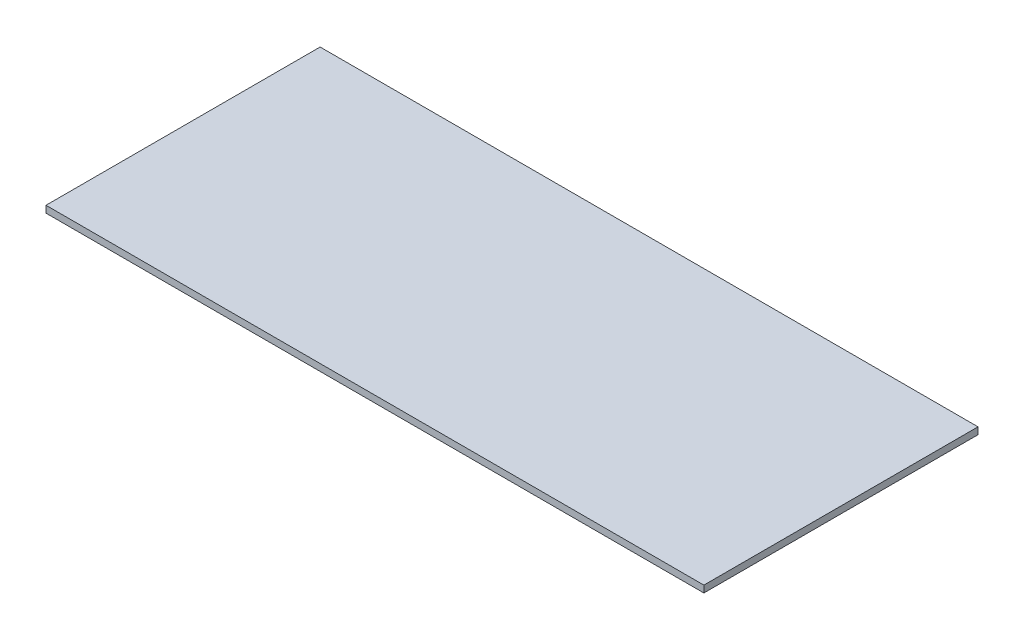
ISO-10303-21;
HEADER;
FILE_DESCRIPTION(('STEP AP214'),'2;1');
FILE_NAME('part.step','',(''),(''),'','','');
FILE_SCHEMA(('AUTOMOTIVE_DESIGN { 1 0 10303 214 1 1 1 1 }'));
ENDSEC;
DATA;
#1=APPLICATION_CONTEXT('core data for automotive mechanical design processes');
#2=APPLICATION_PROTOCOL_DEFINITION('international standard','automotive_design',2000,#1);
#3=PRODUCT_CONTEXT('',#1,'mechanical');
#4=PRODUCT('Part','Part','',(#3));
#5=PRODUCT_RELATED_PRODUCT_CATEGORY('part','',(#4));
#6=PRODUCT_DEFINITION_FORMATION('','',#4);
#7=PRODUCT_DEFINITION_CONTEXT('part definition',#1,'design');
#8=PRODUCT_DEFINITION('design','',#6,#7);
#9=PRODUCT_DEFINITION_SHAPE('','',#8);
#10=(LENGTH_UNIT() NAMED_UNIT(*) SI_UNIT(.MILLI.,.METRE.));
#11=(NAMED_UNIT(*) PLANE_ANGLE_UNIT() SI_UNIT($,.RADIAN.));
#12=(NAMED_UNIT(*) SI_UNIT($,.STERADIAN.) SOLID_ANGLE_UNIT());
#13=UNCERTAINTY_MEASURE_WITH_UNIT(LENGTH_MEASURE(1.E-05),#10,'distance_accuracy_value','');
#14=(GEOMETRIC_REPRESENTATION_CONTEXT(3) GLOBAL_UNCERTAINTY_ASSIGNED_CONTEXT((#13)) GLOBAL_UNIT_ASSIGNED_CONTEXT((#10,
#11,#12)) REPRESENTATION_CONTEXT('',''));
#15=CARTESIAN_POINT('',(0.,0.,0.));
#16=DIRECTION('',(0.,0.,1.));
#17=DIRECTION('',(1.,0.,0.));
#18=AXIS2_PLACEMENT_3D('',#15,#16,#17);
#19=CARTESIAN_POINT('',(-144.,3.,60.));
#20=DIRECTION('',(1.,0.,0.));
#21=DIRECTION('',(0.,0.,-1.));
#22=AXIS2_PLACEMENT_3D('',#19,#20,#21);
#23=PLANE('',#22);
#24=DIRECTION('',(0.,0.,1.));
#25=VECTOR('',#24,1.);
#26=CARTESIAN_POINT('',(-144.,0.,60.));
#27=LINE('',#26,#25);
#28=CARTESIAN_POINT('',(-144.,0.,-60.));
#29=VERTEX_POINT('',#28);
#30=CARTESIAN_POINT('',(-144.,0.,60.));
#31=VERTEX_POINT('',#30);
#32=EDGE_CURVE('E96',#29,#31,#27,.T.);
#33=ORIENTED_EDGE('',*,*,#32,.T.);
#34=DIRECTION('',(0.,-1.,0.));
#35=VECTOR('',#34,1.);
#36=CARTESIAN_POINT('',(-144.,3.,60.));
#37=LINE('',#36,#35);
#38=CARTESIAN_POINT('',(-144.,3.,60.));
#39=VERTEX_POINT('',#38);
#40=EDGE_CURVE('E11',#39,#31,#37,.T.);
#41=ORIENTED_EDGE('',*,*,#40,.F.);
#42=DIRECTION('',(0.,0.,1.));
#43=VECTOR('',#42,1.);
#44=CARTESIAN_POINT('',(-144.,3.,60.));
#45=LINE('',#44,#43);
#46=CARTESIAN_POINT('',(-144.,3.,-60.));
#47=VERTEX_POINT('',#46);
#48=EDGE_CURVE('E84',#47,#39,#45,.T.);
#49=ORIENTED_EDGE('',*,*,#48,.F.);
#50=DIRECTION('',(0.,-1.,0.));
#51=VECTOR('',#50,1.);
#52=CARTESIAN_POINT('',(-144.,3.,-60.));
#53=LINE('',#52,#51);
#54=EDGE_CURVE('E92',#47,#29,#53,.T.);
#55=ORIENTED_EDGE('',*,*,#54,.T.);
#56=EDGE_LOOP('',(#33,#41,#49,#55));
#57=FACE_BOUND('',#56,.T.);
#58=ADVANCED_FACE('F33',(#57),#23,.F.);
#59=CARTESIAN_POINT('',(144.,3.,60.));
#60=DIRECTION('',(0.,0.,-1.));
#61=DIRECTION('',(-1.,0.,0.));
#62=AXIS2_PLACEMENT_3D('',#59,#60,#61);
#63=PLANE('',#62);
#64=DIRECTION('',(1.,0.,0.));
#65=VECTOR('',#64,1.);
#66=CARTESIAN_POINT('',(144.,0.,60.));
#67=LINE('',#66,#65);
#68=CARTESIAN_POINT('',(144.,0.,60.));
#69=VERTEX_POINT('',#68);
#70=EDGE_CURVE('E88',#31,#69,#67,.T.);
#71=ORIENTED_EDGE('',*,*,#70,.T.);
#72=DIRECTION('',(0.,-1.,0.));
#73=VECTOR('',#72,1.);
#74=CARTESIAN_POINT('',(144.,3.,60.));
#75=LINE('',#74,#73);
#76=CARTESIAN_POINT('',(144.,3.,60.));
#77=VERTEX_POINT('',#76);
#78=EDGE_CURVE('E41',#77,#69,#75,.T.);
#79=ORIENTED_EDGE('',*,*,#78,.F.);
#80=DIRECTION('',(1.,0.,0.));
#81=VECTOR('',#80,1.);
#82=CARTESIAN_POINT('',(144.,3.,60.));
#83=LINE('',#82,#81);
#84=EDGE_CURVE('E79',#39,#77,#83,.T.);
#85=ORIENTED_EDGE('',*,*,#84,.F.);
#86=ORIENTED_EDGE('',*,*,#40,.T.);
#87=EDGE_LOOP('',(#71,#79,#85,#86));
#88=FACE_BOUND('',#87,.T.);
#89=ADVANCED_FACE('F87',(#88),#63,.F.);
#90=CARTESIAN_POINT('',(144.,3.,60.));
#91=DIRECTION('',(-1.,0.,0.));
#92=DIRECTION('',(0.,0.,1.));
#93=AXIS2_PLACEMENT_3D('',#90,#91,#92);
#94=PLANE('',#93);
#95=DIRECTION('',(0.,0.,-1.));
#96=VECTOR('',#95,1.);
#97=CARTESIAN_POINT('',(144.,0.,60.));
#98=LINE('',#97,#96);
#99=CARTESIAN_POINT('',(144.,0.,-60.));
#100=VERTEX_POINT('',#99);
#101=EDGE_CURVE('E66',#69,#100,#98,.T.);
#102=ORIENTED_EDGE('',*,*,#101,.T.);
#103=DIRECTION('',(0.,-1.,0.));
#104=VECTOR('',#103,1.);
#105=CARTESIAN_POINT('',(144.,3.,-60.));
#106=LINE('',#105,#104);
#107=CARTESIAN_POINT('',(144.,3.,-60.));
#108=VERTEX_POINT('',#107);
#109=EDGE_CURVE('E89',#108,#100,#106,.T.);
#110=ORIENTED_EDGE('',*,*,#109,.F.);
#111=DIRECTION('',(0.,0.,-1.));
#112=VECTOR('',#111,1.);
#113=CARTESIAN_POINT('',(144.,3.,60.));
#114=LINE('',#113,#112);
#115=EDGE_CURVE('E82',#77,#108,#114,.T.);
#116=ORIENTED_EDGE('',*,*,#115,.F.);
#117=ORIENTED_EDGE('',*,*,#78,.T.);
#118=EDGE_LOOP('',(#102,#110,#116,#117));
#119=FACE_BOUND('',#118,.T.);
#120=ADVANCED_FACE('F90',(#119),#94,.F.);
#121=CARTESIAN_POINT('',(144.,3.,-60.));
#122=DIRECTION('',(0.,0.,1.));
#123=DIRECTION('',(1.,0.,0.));
#124=AXIS2_PLACEMENT_3D('',#121,#122,#123);
#125=PLANE('',#124);
#126=DIRECTION('',(-1.,0.,0.));
#127=VECTOR('',#126,1.);
#128=CARTESIAN_POINT('',(144.,0.,-60.));
#129=LINE('',#128,#127);
#130=EDGE_CURVE('E72',#100,#29,#129,.T.);
#131=ORIENTED_EDGE('',*,*,#130,.T.);
#132=ORIENTED_EDGE('',*,*,#54,.F.);
#133=DIRECTION('',(-1.,0.,0.));
#134=VECTOR('',#133,1.);
#135=CARTESIAN_POINT('',(144.,3.,-60.));
#136=LINE('',#135,#134);
#137=EDGE_CURVE('E49',#108,#47,#136,.T.);
#138=ORIENTED_EDGE('',*,*,#137,.F.);
#139=ORIENTED_EDGE('',*,*,#109,.T.);
#140=EDGE_LOOP('',(#131,#132,#138,#139));
#141=FACE_BOUND('',#140,.T.);
#142=ADVANCED_FACE('F103',(#141),#125,.F.);
#143=CARTESIAN_POINT('',(0.,3.,0.));
#144=DIRECTION('',(0.,1.,0.));
#145=DIRECTION('',(0.,0.,1.));
#146=AXIS2_PLACEMENT_3D('',#143,#144,#145);
#147=PLANE('',#146);
#148=ORIENTED_EDGE('',*,*,#48,.T.);
#149=ORIENTED_EDGE('',*,*,#84,.T.);
#150=ORIENTED_EDGE('',*,*,#115,.T.);
#151=ORIENTED_EDGE('',*,*,#137,.T.);
#152=EDGE_LOOP('',(#148,#149,#150,#151));
#153=FACE_BOUND('',#152,.T.);
#154=ADVANCED_FACE('F80',(#153),#147,.T.);
#155=CARTESIAN_POINT('',(0.,0.,0.));
#156=DIRECTION('',(0.,1.,0.));
#157=DIRECTION('',(0.,0.,1.));
#158=AXIS2_PLACEMENT_3D('',#155,#156,#157);
#159=PLANE('',#158);
#160=ORIENTED_EDGE('',*,*,#32,.F.);
#161=ORIENTED_EDGE('',*,*,#130,.F.);
#162=ORIENTED_EDGE('',*,*,#101,.F.);
#163=ORIENTED_EDGE('',*,*,#70,.F.);
#164=EDGE_LOOP('',(#160,#161,#162,#163));
#165=FACE_BOUND('',#164,.T.);
#166=ADVANCED_FACE('F106',(#165),#159,.F.);
#167=CLOSED_SHELL('',(#58,#89,#120,#142,#154,#166));
#168=MANIFOLD_SOLID_BREP('B2',#167);
#169=ADVANCED_BREP_SHAPE_REPRESENTATION('',(#18,#168),#14);
#170=SHAPE_DEFINITION_REPRESENTATION(#9,#169);
ENDSEC;
END-ISO-10303-21;
